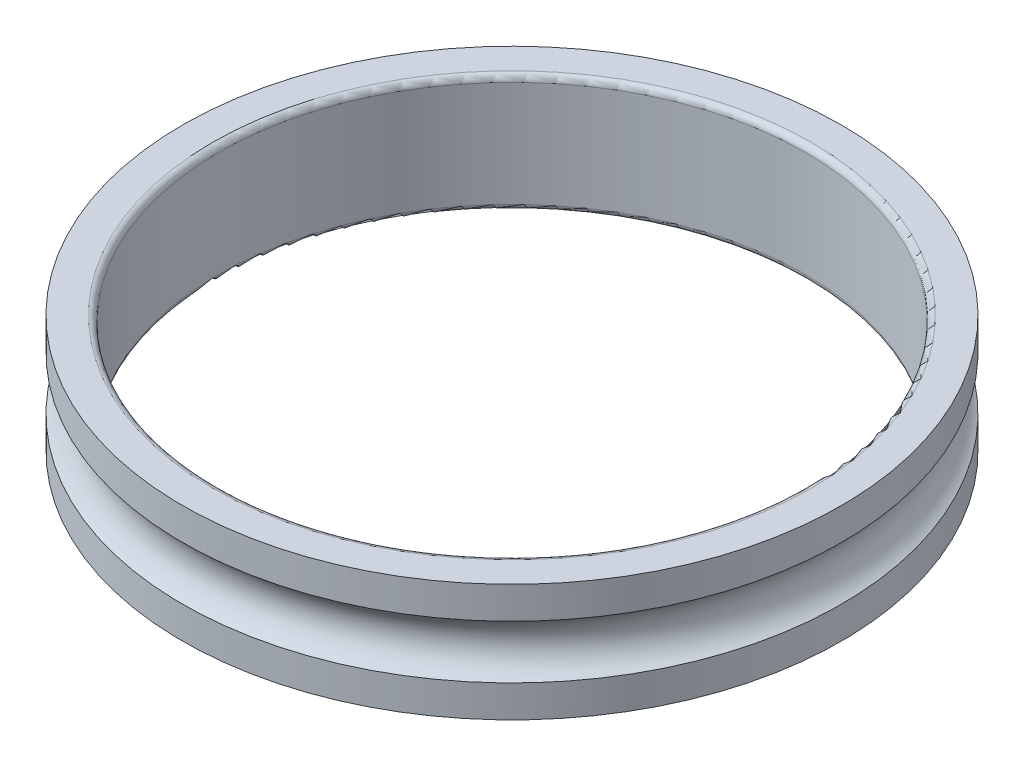
ISO-10303-21;
HEADER;
FILE_DESCRIPTION(('STEP AP214'),'2;1');
FILE_NAME('part.step','',(''),(''),'','','');
FILE_SCHEMA(('AUTOMOTIVE_DESIGN { 1 0 10303 214 1 1 1 1 }'));
ENDSEC;
DATA;
#1=APPLICATION_CONTEXT('core data for automotive mechanical design processes');
#2=APPLICATION_PROTOCOL_DEFINITION('international standard','automotive_design',2000,#1);
#3=PRODUCT_CONTEXT('',#1,'mechanical');
#4=PRODUCT('Part','Part','',(#3));
#5=PRODUCT_RELATED_PRODUCT_CATEGORY('part','',(#4));
#6=PRODUCT_DEFINITION_FORMATION('','',#4);
#7=PRODUCT_DEFINITION_CONTEXT('part definition',#1,'design');
#8=PRODUCT_DEFINITION('design','',#6,#7);
#9=PRODUCT_DEFINITION_SHAPE('','',#8);
#10=(LENGTH_UNIT() NAMED_UNIT(*) SI_UNIT(.MILLI.,.METRE.));
#11=(NAMED_UNIT(*) PLANE_ANGLE_UNIT() SI_UNIT($,.RADIAN.));
#12=(NAMED_UNIT(*) SI_UNIT($,.STERADIAN.) SOLID_ANGLE_UNIT());
#13=UNCERTAINTY_MEASURE_WITH_UNIT(LENGTH_MEASURE(1.E-05),#10,'distance_accuracy_value','');
#14=(GEOMETRIC_REPRESENTATION_CONTEXT(3) GLOBAL_UNCERTAINTY_ASSIGNED_CONTEXT((#13)) GLOBAL_UNIT_ASSIGNED_CONTEXT((#10,
#11,#12)) REPRESENTATION_CONTEXT('',''));
#15=CARTESIAN_POINT('',(0.,0.,0.));
#16=DIRECTION('',(0.,0.,1.));
#17=DIRECTION('',(1.,0.,0.));
#18=AXIS2_PLACEMENT_3D('',#15,#16,#17);
#19=CARTESIAN_POINT('',(0.,-0.54533666301317,0.));
#20=DIRECTION('',(0.,1.,0.));
#21=DIRECTION('',(0.,0.,1.));
#22=AXIS2_PLACEMENT_3D('',#19,#20,#21);
#23=CYLINDRICAL_SURFACE('',#22,11.225);
#24=CARTESIAN_POINT('',(0.,0.,0.));
#25=DIRECTION('',(0.,1.,0.));
#26=DIRECTION('',(0.,0.,1.));
#27=AXIS2_PLACEMENT_3D('',#24,#25,#26);
#28=CIRCLE('',#27,11.225);
#29=CARTESIAN_POINT('',(0.,0.,-11.225));
#30=VERTEX_POINT('',#29);
#31=EDGE_CURVE('E11',#30,#30,#28,.T.);
#32=ORIENTED_EDGE('',*,*,#31,.F.);
#33=EDGE_LOOP('',(#32));
#34=FACE_BOUND('',#33,.T.);
#35=CARTESIAN_POINT('',(0.,-1.09067332602634,0.));
#36=DIRECTION('',(0.,1.,0.));
#37=DIRECTION('',(0.,0.,1.));
#38=AXIS2_PLACEMENT_3D('',#35,#36,#37);
#39=CIRCLE('',#38,11.225);
#40=CARTESIAN_POINT('',(2.12434521794557,-1.09067332602634,11.0221496267739));
#41=VERTEX_POINT('',#40);
#42=EDGE_CURVE('E63',#41,#41,#39,.T.);
#43=ORIENTED_EDGE('',*,*,#42,.T.);
#44=EDGE_LOOP('',(#43));
#45=FACE_BOUND('',#44,.T.);
#46=ADVANCED_FACE('F16',(#34,#45),#23,.T.);
#47=CARTESIAN_POINT('',(0.,0.,10.7125));
#48=DIRECTION('',(0.,1.,0.));
#49=DIRECTION('',(1.,0.,0.));
#50=AXIS2_PLACEMENT_3D('',#47,#48,#49);
#51=PLANE('',#50);
#52=ORIENTED_EDGE('',*,*,#31,.T.);
#53=EDGE_LOOP('',(#52));
#54=FACE_BOUND('',#53,.T.);
#55=CARTESIAN_POINT('',(0.,0.,0.));
#56=DIRECTION('',(0.,1.,0.));
#57=DIRECTION('',(0.,0.,1.));
#58=AXIS2_PLACEMENT_3D('',#55,#56,#57);
#59=CIRCLE('',#58,10.2);
#60=CARTESIAN_POINT('',(0.,0.,-10.2));
#61=VERTEX_POINT('',#60);
#62=EDGE_CURVE('E70',#61,#61,#59,.T.);
#63=ORIENTED_EDGE('',*,*,#62,.F.);
#64=EDGE_LOOP('',(#63));
#65=FACE_BOUND('',#64,.T.);
#66=ADVANCED_FACE('F111',(#54,#65),#51,.T.);
#67=CARTESIAN_POINT('',(0.,-3.45466333698683,0.));
#68=DIRECTION('',(0.,1.,0.));
#69=DIRECTION('',(0.,0.,1.));
#70=AXIS2_PLACEMENT_3D('',#67,#68,#69);
#71=CYLINDRICAL_SURFACE('',#70,11.225);
#72=CARTESIAN_POINT('',(0.,-2.90932667397366,0.));
#73=DIRECTION('',(0.,1.,0.));
#74=DIRECTION('',(0.,0.,1.));
#75=AXIS2_PLACEMENT_3D('',#72,#73,#74);
#76=CIRCLE('',#75,11.225);
#77=CARTESIAN_POINT('',(2.12434521794557,-2.90932667397366,11.0221496267739));
#78=VERTEX_POINT('',#77);
#79=EDGE_CURVE('E80',#78,#78,#76,.T.);
#80=ORIENTED_EDGE('',*,*,#79,.F.);
#81=EDGE_LOOP('',(#80));
#82=FACE_BOUND('',#81,.T.);
#83=CARTESIAN_POINT('',(0.,-4.,0.));
#84=DIRECTION('',(0.,1.,0.));
#85=DIRECTION('',(0.,0.,1.));
#86=AXIS2_PLACEMENT_3D('',#83,#84,#85);
#87=CIRCLE('',#86,11.225);
#88=CARTESIAN_POINT('',(0.,-4.,-11.225));
#89=VERTEX_POINT('',#88);
#90=EDGE_CURVE('E19',#89,#89,#87,.T.);
#91=ORIENTED_EDGE('',*,*,#90,.T.);
#92=EDGE_LOOP('',(#91));
#93=FACE_BOUND('',#92,.T.);
#94=ADVANCED_FACE('F98',(#82,#93),#71,.T.);
#95=CARTESIAN_POINT('',(0.,-4.,10.7125));
#96=DIRECTION('',(0.,-1.,0.));
#97=DIRECTION('',(-1.,0.,0.));
#98=AXIS2_PLACEMENT_3D('',#95,#96,#97);
#99=PLANE('',#98);
#100=CARTESIAN_POINT('',(0.,-4.,0.));
#101=DIRECTION('',(0.,1.,0.));
#102=DIRECTION('',(0.,0.,1.));
#103=AXIS2_PLACEMENT_3D('',#100,#101,#102);
#104=CIRCLE('',#103,10.2);
#105=CARTESIAN_POINT('',(0.,-4.,-10.2));
#106=VERTEX_POINT('',#105);
#107=EDGE_CURVE('E74',#106,#106,#104,.T.);
#108=ORIENTED_EDGE('',*,*,#107,.T.);
#109=EDGE_LOOP('',(#108));
#110=FACE_BOUND('',#109,.T.);
#111=ORIENTED_EDGE('',*,*,#90,.F.);
#112=EDGE_LOOP('',(#111));
#113=FACE_BOUND('',#112,.T.);
#114=ADVANCED_FACE('F100',(#110,#113),#99,.T.);
#115=CARTESIAN_POINT('',(0.,-2.,0.));
#116=DIRECTION('',(0.,1.,0.));
#117=DIRECTION('',(0.,0.,1.));
#118=AXIS2_PLACEMENT_3D('',#115,#116,#117);
#119=TOROIDAL_SURFACE('',#118,11.75,1.05);
#120=ORIENTED_EDGE('',*,*,#79,.T.);
#121=EDGE_LOOP('',(#120));
#122=FACE_BOUND('',#121,.T.);
#123=ORIENTED_EDGE('',*,*,#42,.F.);
#124=EDGE_LOOP('',(#123));
#125=FACE_BOUND('',#124,.T.);
#126=ADVANCED_FACE('F102',(#122,#125),#119,.F.);
#127=CARTESIAN_POINT('',(0.,-0.2,0.));
#128=DIRECTION('',(0.,1.,0.));
#129=DIRECTION('',(0.,0.,1.));
#130=AXIS2_PLACEMENT_3D('',#127,#128,#129);
#131=TOROIDAL_SURFACE('',#130,10.2,0.2);
#132=CARTESIAN_POINT('',(0.,-0.2,0.));
#133=DIRECTION('',(0.,1.,0.));
#134=DIRECTION('',(0.,0.,1.));
#135=AXIS2_PLACEMENT_3D('',#132,#133,#134);
#136=CIRCLE('',#135,10.);
#137=CARTESIAN_POINT('',(0.,-0.2,-10.));
#138=VERTEX_POINT('',#137);
#139=EDGE_CURVE('E137',#138,#138,#136,.T.);
#140=ORIENTED_EDGE('',*,*,#139,.F.);
#141=EDGE_LOOP('',(#140));
#142=FACE_BOUND('',#141,.T.);
#143=ORIENTED_EDGE('',*,*,#62,.T.);
#144=EDGE_LOOP('',(#143));
#145=FACE_BOUND('',#144,.T.);
#146=ADVANCED_FACE('F71',(#142,#145),#131,.T.);
#147=CARTESIAN_POINT('',(0.,-3.8,0.));
#148=DIRECTION('',(0.,1.,0.));
#149=DIRECTION('',(0.,0.,1.));
#150=AXIS2_PLACEMENT_3D('',#147,#148,#149);
#151=TOROIDAL_SURFACE('',#150,10.2,0.2);
#152=ORIENTED_EDGE('',*,*,#107,.F.);
#153=EDGE_LOOP('',(#152));
#154=FACE_BOUND('',#153,.T.);
#155=CARTESIAN_POINT('',(0.,-3.8,0.));
#156=DIRECTION('',(0.,1.,0.));
#157=DIRECTION('',(0.,0.,1.));
#158=AXIS2_PLACEMENT_3D('',#155,#156,#157);
#159=CIRCLE('',#158,10.);
#160=CARTESIAN_POINT('',(0.,-3.8,-10.));
#161=VERTEX_POINT('',#160);
#162=EDGE_CURVE('E83',#161,#161,#159,.T.);
#163=ORIENTED_EDGE('',*,*,#162,.T.);
#164=EDGE_LOOP('',(#163));
#165=FACE_BOUND('',#164,.T.);
#166=ADVANCED_FACE('F125',(#154,#165),#151,.T.);
#167=CARTESIAN_POINT('',(0.,-2.,0.));
#168=DIRECTION('',(0.,1.,0.));
#169=DIRECTION('',(0.,0.,1.));
#170=AXIS2_PLACEMENT_3D('',#167,#168,#169);
#171=CYLINDRICAL_SURFACE('',#170,10.);
#172=ORIENTED_EDGE('',*,*,#162,.F.);
#173=EDGE_LOOP('',(#172));
#174=FACE_BOUND('',#173,.T.);
#175=ORIENTED_EDGE('',*,*,#139,.T.);
#176=EDGE_LOOP('',(#175));
#177=FACE_BOUND('',#176,.T.);
#178=ADVANCED_FACE('F127',(#174,#177),#171,.F.);
#179=CLOSED_SHELL('',(#46,#66,#94,#114,#126,#146,#166,#178));
#180=MANIFOLD_SOLID_BREP('B1',#179);
#181=ADVANCED_BREP_SHAPE_REPRESENTATION('',(#18,#180),#14);
#182=SHAPE_DEFINITION_REPRESENTATION(#9,#181);
ENDSEC;
END-ISO-10303-21;
